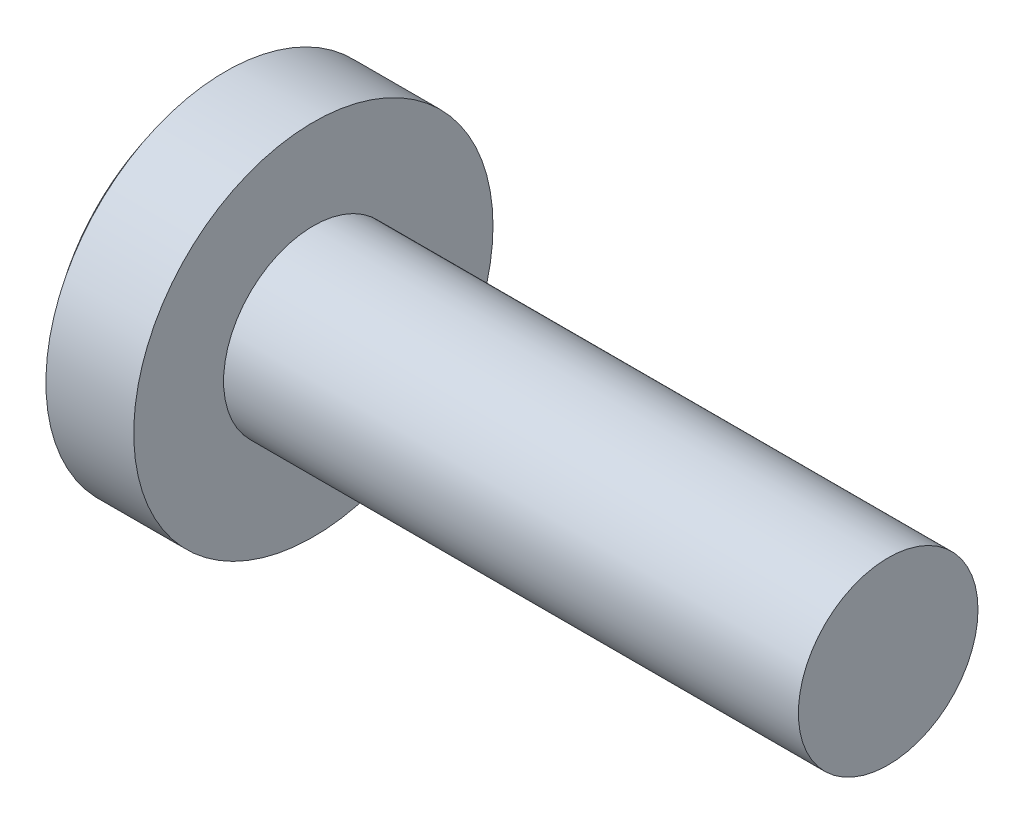
ISO-10303-21;
HEADER;
FILE_DESCRIPTION(('STEP AP214'),'2;1');
FILE_NAME('part.step','',(''),(''),'','','');
FILE_SCHEMA(('AUTOMOTIVE_DESIGN { 1 0 10303 214 1 1 1 1 }'));
ENDSEC;
DATA;
#1=APPLICATION_CONTEXT('core data for automotive mechanical design processes');
#2=APPLICATION_PROTOCOL_DEFINITION('international standard','automotive_design',2000,#1);
#3=PRODUCT_CONTEXT('',#1,'mechanical');
#4=PRODUCT('Part','Part','',(#3));
#5=PRODUCT_RELATED_PRODUCT_CATEGORY('part','',(#4));
#6=PRODUCT_DEFINITION_FORMATION('','',#4);
#7=PRODUCT_DEFINITION_CONTEXT('part definition',#1,'design');
#8=PRODUCT_DEFINITION('design','',#6,#7);
#9=PRODUCT_DEFINITION_SHAPE('','',#8);
#10=(LENGTH_UNIT() NAMED_UNIT(*) SI_UNIT(.MILLI.,.METRE.));
#11=(NAMED_UNIT(*) PLANE_ANGLE_UNIT() SI_UNIT($,.RADIAN.));
#12=(NAMED_UNIT(*) SI_UNIT($,.STERADIAN.) SOLID_ANGLE_UNIT());
#13=UNCERTAINTY_MEASURE_WITH_UNIT(LENGTH_MEASURE(1.E-05),#10,'distance_accuracy_value','');
#14=(GEOMETRIC_REPRESENTATION_CONTEXT(3) GLOBAL_UNCERTAINTY_ASSIGNED_CONTEXT((#13)) GLOBAL_UNIT_ASSIGNED_CONTEXT((#10,
#11,#12)) REPRESENTATION_CONTEXT('',''));
#15=CARTESIAN_POINT('',(0.,0.,0.));
#16=DIRECTION('',(0.,0.,1.));
#17=DIRECTION('',(1.,0.,0.));
#18=AXIS2_PLACEMENT_3D('',#15,#16,#17);
#19=CARTESIAN_POINT('',(4.00000000000003,0.,0.));
#20=DIRECTION('',(1.,0.,0.));
#21=DIRECTION('',(0.,0.999999999999999,0.));
#22=AXIS2_PLACEMENT_3D('',#19,#20,#21);
#23=SPHERICAL_SURFACE('',#22,4.);
#24=CARTESIAN_POINT('',(0.877501000800831,0.,0.));
#25=DIRECTION('',(1.,0.,0.));
#26=DIRECTION('',(0.,0.,-1.));
#27=AXIS2_PLACEMENT_3D('',#24,#25,#26);
#28=CIRCLE('',#27,2.5);
#29=CARTESIAN_POINT('',(0.877501000800831,0.,-2.50000000000006));
#30=VERTEX_POINT('',#29);
#31=EDGE_CURVE('E238',#30,#30,#28,.T.);
#32=ORIENTED_EDGE('',*,*,#31,.F.);
#33=EDGE_LOOP('',(#32));
#34=FACE_BOUND('',#33,.T.);
#35=CARTESIAN_POINT('',(4.00000000000003,-0.270000000000041,1.94289029309402E-13));
#36=DIRECTION('',(0.,1.,0.));
#37=DIRECTION('',(0.,0.,0.999999999999999));
#38=AXIS2_PLACEMENT_3D('',#35,#36,#37);
#39=CIRCLE('',#38,3.99087709657915);
#40=CARTESIAN_POINT('',(0.204098003289626,-0.269999999999875,1.23216396285989));
#41=VERTEX_POINT('',#40);
#42=CARTESIAN_POINT('',(0.0500379748661125,-0.269999999999708,0.570000000000126));
#43=VERTEX_POINT('',#42);
#44=EDGE_CURVE('E164',#41,#43,#39,.F.);
#45=ORIENTED_EDGE('',*,*,#44,.T.);
#46=CARTESIAN_POINT('',(0.0500379748661125,-0.269999999999708,0.570000000000126));
#47=CARTESIAN_POINT('',(0.0476365178428042,-0.269985184552494,0.553373124210486));
#48=CARTESIAN_POINT('',(0.0454365510042585,-0.27138160355786,0.536716423851874));
#49=CARTESIAN_POINT('',(0.0414945222549717,-0.276920928483508,0.503814447887959));
#50=CARTESIAN_POINT('',(0.0397523590868071,-0.281063226352656,0.487569082022859));
#51=CARTESIAN_POINT('',(0.0367783746538531,-0.292023458963572,0.455938437330691));
#52=CARTESIAN_POINT('',(0.0355470274039683,-0.298843867504526,0.440553968777926));
#53=CARTESIAN_POINT('',(0.0336346247987305,-0.31497358110974,0.41111996094181));
#54=CARTESIAN_POINT('',(0.0329533539085992,-0.324281909435062,0.397069900707179));
#55=CARTESIAN_POINT('',(0.0321661245530753,-0.345012414579545,0.370859945854032));
#56=CARTESIAN_POINT('',(0.0320539368362138,-0.356410282064379,0.358681006749266));
#57=CARTESIAN_POINT('',(0.0323915144837283,-0.381061876423687,0.336379293067998));
#58=CARTESIAN_POINT('',(0.0328413529561471,-0.394315844539517,0.326256786190161));
#59=CARTESIAN_POINT('',(0.0342854793189419,-0.422222756005893,0.308399045220797));
#60=CARTESIAN_POINT('',(0.0352770585079761,-0.436868442273225,0.300652231095505));
#61=CARTESIAN_POINT('',(0.0377733498840623,-0.467195800491755,0.287682726898461));
#62=CARTESIAN_POINT('',(0.0392779221655499,-0.482877189042834,0.282459349562497));
#63=CARTESIAN_POINT('',(0.0422857118746872,-0.51051670914062,0.275710674843325));
#64=CARTESIAN_POINT('',(0.043680199533087,-0.522340381271561,0.273568319498996));
#65=CARTESIAN_POINT('',(0.0466949672489457,-0.546113264286471,0.270712687639845));
#66=CARTESIAN_POINT('',(0.0483149200494709,-0.558062270415653,0.269997362497121));
#67=CARTESIAN_POINT('',(0.0500379748661134,-0.570000000000126,0.269999999999937));
#68=B_SPLINE_CURVE_WITH_KNOTS('',3,(#46,#47,#48,#49,#50,#51,#52,#53,#54,#55,#56,#57,#58,#59,#60,
#61,#62,#63,#64,#65,#66,#67),.UNSPECIFIED.,.F.,.F.,(4,2,2,2,2,2,2,2,2,2,4),(0.,
0.050340275914424,0.100669408132157,0.151045139681411,0.201401123066347,0.251204696018701,
0.301014748065684,0.350577999468998,0.400127744578377,0.436335011021502,0.472490261222945),.UNSPECIFIED.);
#69=CARTESIAN_POINT('',(0.0500379748661134,-0.570000000000126,0.269999999999937));
#70=VERTEX_POINT('',#69);
#71=EDGE_CURVE('E149',#43,#70,#68,.T.);
#72=ORIENTED_EDGE('',*,*,#71,.T.);
#73=CARTESIAN_POINT('',(4.00000000000004,-2.70616862252382E-13,0.269999999999743));
#74=DIRECTION('',(0.,0.,-1.));
#75=DIRECTION('',(0.,0.999999999999999,0.));
#76=AXIS2_PLACEMENT_3D('',#73,#74,#75);
#77=CIRCLE('',#76,3.99087709657915);
#78=CARTESIAN_POINT('',(0.204098003289605,-1.23216396285963,0.269999999999923));
#79=VERTEX_POINT('',#78);
#80=EDGE_CURVE('E173',#70,#79,#77,.F.);
#81=ORIENTED_EDGE('',*,*,#80,.T.);
#82=CARTESIAN_POINT('',(3.58456714755454,0.719550807568865,-2.08166817117217E-13));
#83=DIRECTION('',(-0.500000000000003,0.866025403784437,0.));
#84=DIRECTION('',(-0.866025403784442,-0.500000000000001,0.));
#85=AXIS2_PLACEMENT_3D('',#82,#83,#84);
#86=CIRCLE('',#85,3.91275634054);
#87=CARTESIAN_POINT('',(0.204098003289641,-1.23216396285969,-0.269999999999784));
#88=VERTEX_POINT('',#87);
#89=EDGE_CURVE('E176',#79,#88,#86,.F.);
#90=ORIENTED_EDGE('',*,*,#89,.T.);
#91=CARTESIAN_POINT('',(4.00000000000004,0.,-0.270000000000194));
#92=DIRECTION('',(0.,0.,1.));
#93=DIRECTION('',(1.,0.,0.));
#94=AXIS2_PLACEMENT_3D('',#91,#92,#93);
#95=CIRCLE('',#94,3.99087709657915);
#96=CARTESIAN_POINT('',(0.0500379748661029,-0.57000000000007,-0.270000000000069));
#97=VERTEX_POINT('',#96);
#98=EDGE_CURVE('E266',#88,#97,#95,.F.);
#99=ORIENTED_EDGE('',*,*,#98,.T.);
#100=CARTESIAN_POINT('',(0.0500379748661029,-0.57000000000007,-0.270000000000069));
#101=CARTESIAN_POINT('',(0.0476365178428165,-0.553373124210525,-0.269985184553142));
#102=CARTESIAN_POINT('',(0.0454365510042719,-0.536716423851851,-0.271381603558377));
#103=CARTESIAN_POINT('',(0.041494522254977,-0.503814447887767,-0.276920928483654));
#104=CARTESIAN_POINT('',(0.0397523590868037,-0.48756908202256,-0.281063226352564));
#105=CARTESIAN_POINT('',(0.0367783746538686,-0.455938437330545,-0.292023458963583));
#106=CARTESIAN_POINT('',(0.035547027404008,-0.440553968778035,-0.298843867504861));
#107=CARTESIAN_POINT('',(0.0336346247987634,-0.411119960941992,-0.314973581109942));
#108=CARTESIAN_POINT('',(0.0329533539086009,-0.397069900707179,-0.324281909434806));
#109=CARTESIAN_POINT('',(0.0321661245530739,-0.370859945854137,-0.345012414579102));
#110=CARTESIAN_POINT('',(0.032053936836242,-0.358681006749658,-0.356410282064208));
#111=CARTESIAN_POINT('',(0.0323915144837608,-0.336379293068539,-0.381061876423621));
#112=CARTESIAN_POINT('',(0.032841352956155,-0.326256786190566,-0.394315844539287));
#113=CARTESIAN_POINT('',(0.0342854793189419,-0.308399045221053,-0.422222756005631));
#114=CARTESIAN_POINT('',(0.0352770585079974,-0.300652231095767,-0.436868442273106));
#115=CARTESIAN_POINT('',(0.0377733498840705,-0.287682726898643,-0.467195800491854));
#116=CARTESIAN_POINT('',(0.0392779221655235,-0.282459349562591,-0.482877189043007));
#117=CARTESIAN_POINT('',(0.0422857118746707,-0.275710674843401,-0.5105167091408));
#118=CARTESIAN_POINT('',(0.0436801995330887,-0.273568319499098,-0.522340381271661));
#119=CARTESIAN_POINT('',(0.0466949672489684,-0.270712687639989,-0.546113264286423));
#120=CARTESIAN_POINT('',(0.0483149200494965,-0.269997362497282,-0.558062270415538));
#121=CARTESIAN_POINT('',(0.0500379748661021,-0.270000000000097,-0.569999999999939));
#122=B_SPLINE_CURVE_WITH_KNOTS('',3,(#100,#101,#102,#103,#104,#105,#106,#107,#108,#109,#110,
#111,#112,#113,#114,#115,#116,#117,#118,#119,#120,#121),.UNSPECIFIED.,.F.,.F.,(4,2,2,2,2,2,2,2,
2,2,4),(0.,0.0503402759144627,0.100669408132281,0.151045139681269,0.201401123065908,
0.251204696018142,0.301014748065041,0.35057799946869,0.40012774457837,0.436335011021249,
0.472490261222481),.UNSPECIFIED.);
#123=CARTESIAN_POINT('',(0.0500379748661021,-0.270000000000097,-0.569999999999939));
#124=VERTEX_POINT('',#123);
#125=EDGE_CURVE('E160',#97,#124,#122,.T.);
#126=ORIENTED_EDGE('',*,*,#125,.T.);
#127=CARTESIAN_POINT('',(4.00000000000003,-0.270000000000041,1.94289029309402E-13));
#128=DIRECTION('',(0.,0.999999999999999,0.));
#129=DIRECTION('',(0.,0.,1.));
#130=AXIS2_PLACEMENT_3D('',#127,#128,#129);
#131=CIRCLE('',#130,3.99087709657915);
#132=CARTESIAN_POINT('',(0.204098003289616,-0.269999999999992,-1.23216396285973));
#133=VERTEX_POINT('',#132);
#134=EDGE_CURVE('E265',#124,#133,#131,.F.);
#135=ORIENTED_EDGE('',*,*,#134,.T.);
#136=CARTESIAN_POINT('',(3.58456714755454,0.,0.719550807568733));
#137=DIRECTION('',(-0.500000000000003,0.,0.866025403784439));
#138=DIRECTION('',(0.866025403784442,0.,0.500000000000002));
#139=AXIS2_PLACEMENT_3D('',#136,#137,#138);
#140=CIRCLE('',#139,3.91275634054);
#141=CARTESIAN_POINT('',(0.204098003289619,0.269999999999999,-1.23216396285981));
#142=VERTEX_POINT('',#141);
#143=EDGE_CURVE('E264',#133,#142,#140,.F.);
#144=ORIENTED_EDGE('',*,*,#143,.T.);
#145=CARTESIAN_POINT('',(4.00000000000003,0.269999999999937,0.));
#146=DIRECTION('',(0.,-0.999999999999999,0.));
#147=DIRECTION('',(0.,0.,-1.));
#148=AXIS2_PLACEMENT_3D('',#145,#146,#147);
#149=CIRCLE('',#148,3.99087709657915);
#150=CARTESIAN_POINT('',(0.0500379748661012,0.269999999999999,-0.569999999999925));
#151=VERTEX_POINT('',#150);
#152=EDGE_CURVE('E261',#142,#151,#149,.F.);
#153=ORIENTED_EDGE('',*,*,#152,.T.);
#154=CARTESIAN_POINT('',(0.0500379748661012,0.269999999999999,-0.569999999999925));
#155=CARTESIAN_POINT('',(0.0476365178427653,0.269985184552828,-0.553373124210335));
#156=CARTESIAN_POINT('',(0.0454365510042193,0.271381603558045,-0.536716423851665));
#157=CARTESIAN_POINT('',(0.041494522254949,0.276920928483414,-0.503814447887631));
#158=CARTESIAN_POINT('',(0.039752359086801,0.281063226352429,-0.487569082022471));
#159=CARTESIAN_POINT('',(0.0367783746538622,0.292023458963476,-0.455938437330423));
#160=CARTESIAN_POINT('',(0.0355470274039744,0.298843867504686,-0.440553968777837));
#161=CARTESIAN_POINT('',(0.0336346247987289,0.314973581109855,-0.411119960941745));
#162=CARTESIAN_POINT('',(0.032953353908593,0.324281909434876,-0.39706990070696));
#163=CARTESIAN_POINT('',(0.0321661245530798,0.345012414579296,-0.370859945853949));
#164=CARTESIAN_POINT('',(0.0320539368362334,0.356410282064361,-0.358681006749468));
#165=CARTESIAN_POINT('',(0.0323915144837456,0.381061876423662,-0.336379293068259));
#166=CARTESIAN_POINT('',(0.0328413529561473,0.394315844539254,-0.326256786190195));
#167=CARTESIAN_POINT('',(0.034285479318946,0.422222756005606,-0.308399045220813));
#168=CARTESIAN_POINT('',(0.0352770585080059,0.436868442273162,-0.300652231095746));
#169=CARTESIAN_POINT('',(0.0377733498840755,0.467195800491913,-0.287682726898643));
#170=CARTESIAN_POINT('',(0.039277922165521,0.482877189042989,-0.282459349562396));
#171=CARTESIAN_POINT('',(0.0422857118746738,0.51051670914078,-0.275710674843273));
#172=CARTESIAN_POINT('',(0.0436801995331013,0.522340381271688,-0.273568319499126));
#173=CARTESIAN_POINT('',(0.0466949672489883,0.546113264286518,-0.270712687640183));
#174=CARTESIAN_POINT('',(0.0483149200495141,0.558062270415652,-0.269997362497487));
#175=CARTESIAN_POINT('',(0.0500379748661012,0.570000000000022,-0.270000000000034));
#176=B_SPLINE_CURVE_WITH_KNOTS('',3,(#154,#155,#156,#157,#158,#159,#160,#161,#162,#163,#164,
#165,#166,#167,#168,#169,#170,#171,#172,#173,#174,#175),.UNSPECIFIED.,.F.,.F.,(4,2,2,2,2,2,2,2,
2,2,4),(0.,0.0503402759144768,0.100669408132236,0.151045139681354,0.20140112306616,
0.251204696018365,0.301014748065203,0.350577999468785,0.400127744578427,0.436335011021359,
0.472490261222617),.UNSPECIFIED.);
#177=CARTESIAN_POINT('',(0.0500379748661012,0.570000000000022,-0.270000000000034));
#178=VERTEX_POINT('',#177);
#179=EDGE_CURVE('E167',#151,#178,#176,.T.);
#180=ORIENTED_EDGE('',*,*,#179,.T.);
#181=CARTESIAN_POINT('',(4.00000000000004,0.,-0.270000000000194));
#182=DIRECTION('',(0.,0.,1.));
#183=DIRECTION('',(1.,0.,0.));
#184=AXIS2_PLACEMENT_3D('',#181,#182,#183);
#185=CIRCLE('',#184,3.99087709657915);
#186=CARTESIAN_POINT('',(0.204098003289628,1.2321639628597,-0.269999999999979));
#187=VERTEX_POINT('',#186);
#188=EDGE_CURVE('E259',#178,#187,#185,.F.);
#189=ORIENTED_EDGE('',*,*,#188,.T.);
#190=CARTESIAN_POINT('',(3.58456714755454,-0.719550807569025,-1.2490009027033E-13));
#191=DIRECTION('',(-0.500000000000003,-0.86602540378444,0.));
#192=DIRECTION('',(0.866025403784442,-0.500000000000002,0.));
#193=AXIS2_PLACEMENT_3D('',#190,#191,#192);
#194=CIRCLE('',#193,3.91275634054);
#195=CARTESIAN_POINT('',(0.204098003289599,1.23216396285981,0.269999999999729));
#196=VERTEX_POINT('',#195);
#197=EDGE_CURVE('E258',#187,#196,#194,.F.);
#198=ORIENTED_EDGE('',*,*,#197,.T.);
#199=CARTESIAN_POINT('',(4.00000000000004,-2.70616862252382E-13,0.269999999999743));
#200=DIRECTION('',(0.,0.,-0.999999999999999));
#201=DIRECTION('',(0.,1.,0.));
#202=AXIS2_PLACEMENT_3D('',#199,#200,#201);
#203=CIRCLE('',#202,3.99087709657915);
#204=CARTESIAN_POINT('',(0.0500379748660804,0.570000000000126,0.270000000000173));
#205=VERTEX_POINT('',#204);
#206=EDGE_CURVE('E255',#196,#205,#203,.F.);
#207=ORIENTED_EDGE('',*,*,#206,.T.);
#208=CARTESIAN_POINT('',(0.0500379748660804,0.570000000000126,0.270000000000173));
#209=CARTESIAN_POINT('',(0.0476365178427624,0.553373124210416,0.269985184552697));
#210=CARTESIAN_POINT('',(0.0454365510042224,0.53671642385173,0.271381603557916));
#211=CARTESIAN_POINT('',(0.0414945222549525,0.503814447887699,0.276920928483413));
#212=CARTESIAN_POINT('',(0.0397523590867985,0.487569082022558,0.281063226352553));
#213=CARTESIAN_POINT('',(0.0367783746538508,0.455938437330451,0.292023458963465));
#214=CARTESIAN_POINT('',(0.0355470274039577,0.440553968777784,0.298843867504403));
#215=CARTESIAN_POINT('',(0.0336346247987169,0.411119960941894,0.314973581109608));
#216=CARTESIAN_POINT('',(0.0329533539085912,0.397069900707394,0.324281909434938));
#217=CARTESIAN_POINT('',(0.0321661245530579,0.370859945854221,0.345012414579314));
#218=CARTESIAN_POINT('',(0.0320539368361857,0.358681006749313,0.356410282064052));
#219=CARTESIAN_POINT('',(0.0323915144837039,0.33637929306802,0.381061876423387));
#220=CARTESIAN_POINT('',(0.0328413529561372,0.3262567861903,0.394315844539342));
#221=CARTESIAN_POINT('',(0.0342854793189297,0.308399045220861,0.422222756005786));
#222=CARTESIAN_POINT('',(0.0352770585079478,0.30065223109538,0.436868442273063));
#223=CARTESIAN_POINT('',(0.0377733498840293,0.287682726898234,0.467195800491608));
#224=CARTESIAN_POINT('',(0.0392779221655282,0.282459349562357,0.482877189042758));
#225=CARTESIAN_POINT('',(0.0422857118746647,0.275710674843167,0.510516709140553));
#226=CARTESIAN_POINT('',(0.0436801995330547,0.273568319498776,0.522340381271443));
#227=CARTESIAN_POINT('',(0.0466949672489052,0.270712687639629,0.546113264286271));
#228=CARTESIAN_POINT('',(0.0483149200494319,0.269997362496972,0.558062270415422));
#229=CARTESIAN_POINT('',(0.0500379748660917,0.270000000000048,0.56999999999989));
#230=B_SPLINE_CURVE_WITH_KNOTS('',3,(#208,#209,#210,#211,#212,#213,#214,#215,#216,#217,#218,
#219,#220,#221,#222,#223,#224,#225,#226,#227,#228,#229),.UNSPECIFIED.,.F.,.F.,(4,2,2,2,2,2,2,2,
2,2,4),(0.,0.0503402759145948,0.100669408132425,0.15104513968138,0.20140112306604,
0.251204696018483,0.301014748065558,0.350577999468997,0.400127744578482,0.436335011021489,
0.472490261222843),.UNSPECIFIED.);
#231=CARTESIAN_POINT('',(0.0500379748660917,0.270000000000048,0.56999999999989));
#232=VERTEX_POINT('',#231);
#233=EDGE_CURVE('E187',#205,#232,#230,.T.);
#234=ORIENTED_EDGE('',*,*,#233,.T.);
#235=CARTESIAN_POINT('',(4.00000000000003,0.269999999999937,0.));
#236=DIRECTION('',(0.,-1.,0.));
#237=DIRECTION('',(0.,0.,-0.999999999999999));
#238=AXIS2_PLACEMENT_3D('',#235,#236,#237);
#239=CIRCLE('',#238,3.99087709657915);
#240=CARTESIAN_POINT('',(0.204098003289631,0.269999999999937,1.23216396285959));
#241=VERTEX_POINT('',#240);
#242=EDGE_CURVE('E168',#232,#241,#239,.F.);
#243=ORIENTED_EDGE('',*,*,#242,.T.);
#244=CARTESIAN_POINT('',(3.58456714755455,0.,-0.719550807569268));
#245=DIRECTION('',(-0.500000000000003,0.,-0.866025403784439));
#246=DIRECTION('',(-0.866025403784442,0.,0.500000000000002));
#247=AXIS2_PLACEMENT_3D('',#244,#245,#246);
#248=CIRCLE('',#247,3.91275634054);
#249=EDGE_CURVE('E172',#241,#41,#248,.F.);
#250=ORIENTED_EDGE('',*,*,#249,.T.);
#251=EDGE_LOOP('',(#45,#72,#81,#90,#99,#126,#135,#144,#153,#180,#189,#198,#207,#234,#243,#250));
#252=FACE_BOUND('',#251,.T.);
#253=ADVANCED_FACE('F39',(#34,#252),#23,.T.);
#254=CARTESIAN_POINT('',(10.1,1.24999999999965,-1.66533453693773E-13));
#255=DIRECTION('',(1.,0.,0.));
#256=DIRECTION('',(0.,0.,-1.));
#257=AXIS2_PLACEMENT_3D('',#254,#255,#256);
#258=PLANE('',#257);
#259=CARTESIAN_POINT('',(10.1000000000001,-2.22044604925031E-13,2.70616862252382E-13));
#260=DIRECTION('',(1.,0.,0.));
#261=DIRECTION('',(0.,0.,-1.));
#262=AXIS2_PLACEMENT_3D('',#259,#260,#261);
#263=CIRCLE('',#262,1.25);
#264=CARTESIAN_POINT('',(10.1000000000001,-2.21211937656562E-13,-1.24999999999973));
#265=VERTEX_POINT('',#264);
#266=EDGE_CURVE('E252',#265,#265,#263,.T.);
#267=ORIENTED_EDGE('',*,*,#266,.T.);
#268=EDGE_LOOP('',(#267));
#269=FACE_BOUND('',#268,.T.);
#270=ADVANCED_FACE('F228',(#269),#258,.T.);
#271=CARTESIAN_POINT('',(4.51581291088135,0.,0.));
#272=DIRECTION('',(1.,0.,0.));
#273=DIRECTION('',(0.,0.,-1.));
#274=AXIS2_PLACEMENT_3D('',#271,#272,#273);
#275=CYLINDRICAL_SURFACE('',#274,1.25);
#276=CARTESIAN_POINT('',(2.10000000000004,0.,0.));
#277=DIRECTION('',(1.,0.,0.));
#278=DIRECTION('',(0.,0.,-1.));
#279=AXIS2_PLACEMENT_3D('',#276,#277,#278);
#280=CIRCLE('',#279,1.25);
#281=CARTESIAN_POINT('',(2.10000000000004,0.,-1.25000000000006));
#282=VERTEX_POINT('',#281);
#283=EDGE_CURVE('E245',#282,#282,#280,.T.);
#284=ORIENTED_EDGE('',*,*,#283,.T.);
#285=EDGE_LOOP('',(#284));
#286=FACE_BOUND('',#285,.T.);
#287=ORIENTED_EDGE('',*,*,#266,.F.);
#288=EDGE_LOOP('',(#287));
#289=FACE_BOUND('',#288,.T.);
#290=ADVANCED_FACE('F233',(#286,#289),#275,.T.);
#291=CARTESIAN_POINT('',(2.10000000000005,1.55000000000006,0.));
#292=DIRECTION('',(1.,0.,0.));
#293=DIRECTION('',(0.,0.,-1.));
#294=AXIS2_PLACEMENT_3D('',#291,#292,#293);
#295=PLANE('',#294);
#296=CARTESIAN_POINT('',(2.10000000000004,0.,0.));
#297=DIRECTION('',(1.,0.,0.));
#298=DIRECTION('',(0.,0.,-1.));
#299=AXIS2_PLACEMENT_3D('',#296,#297,#298);
#300=CIRCLE('',#299,2.5);
#301=CARTESIAN_POINT('',(2.10000000000004,0.,-2.50000000000006));
#302=VERTEX_POINT('',#301);
#303=EDGE_CURVE('E240',#302,#302,#300,.T.);
#304=ORIENTED_EDGE('',*,*,#303,.T.);
#305=EDGE_LOOP('',(#304));
#306=FACE_BOUND('',#305,.T.);
#307=ORIENTED_EDGE('',*,*,#283,.F.);
#308=EDGE_LOOP('',(#307));
#309=FACE_BOUND('',#308,.T.);
#310=ADVANCED_FACE('F482',(#306,#309),#295,.T.);
#311=CARTESIAN_POINT('',(4.51581291088135,0.,0.));
#312=DIRECTION('',(1.,0.,0.));
#313=DIRECTION('',(0.,0.,-1.));
#314=AXIS2_PLACEMENT_3D('',#311,#312,#313);
#315=CYLINDRICAL_SURFACE('',#314,2.5);
#316=ORIENTED_EDGE('',*,*,#31,.T.);
#317=EDGE_LOOP('',(#316));
#318=FACE_BOUND('',#317,.T.);
#319=ORIENTED_EDGE('',*,*,#303,.F.);
#320=EDGE_LOOP('',(#319));
#321=FACE_BOUND('',#320,.T.);
#322=ADVANCED_FACE('F224',(#318,#321),#315,.T.);
#323=CARTESIAN_POINT('',(1.47000000000004,0.269999999999881,0.269999999999909));
#324=DIRECTION('',(0.,-1.,0.));
#325=DIRECTION('',(0.,0.,-0.999999999999999));
#326=AXIS2_PLACEMENT_3D('',#323,#324,#325);
#327=PLANE('',#326);
#328=ORIENTED_EDGE('',*,*,#242,.F.);
#329=DIRECTION('',(-1.,0.,0.));
#330=VECTOR('',#329,1.);
#331=CARTESIAN_POINT('',(1.47000000000004,0.269999999999937,0.569999999999564));
#332=LINE('',#331,#330);
#333=CARTESIAN_POINT('',(1.35099962990375,0.269999999999881,0.569999999999647));
#334=VERTEX_POINT('',#333);
#335=EDGE_CURVE('E343',#232,#334,#332,.F.);
#336=ORIENTED_EDGE('',*,*,#335,.T.);
#337=DIRECTION('',(-0.866025403784442,0.,0.500000000000001));
#338=VECTOR('',#337,1.);
#339=CARTESIAN_POINT('',(0.,0.269999999999999,1.35000000000018));
#340=LINE('',#339,#338);
#341=EDGE_CURVE('E241',#334,#241,#340,.T.);
#342=ORIENTED_EDGE('',*,*,#341,.T.);
#343=EDGE_LOOP('',(#328,#336,#342));
#344=FACE_BOUND('',#343,.T.);
#345=ADVANCED_FACE('F217',(#344),#327,.T.);
#346=CARTESIAN_POINT('',(0.,0.,1.34999999999992));
#347=DIRECTION('',(-0.500000000000003,0.,-0.866025403784439));
#348=DIRECTION('',(-0.866025403784442,0.,0.500000000000002));
#349=AXIS2_PLACEMENT_3D('',#346,#347,#348);
#350=PLANE('',#349);
#351=ORIENTED_EDGE('',*,*,#341,.F.);
#352=CARTESIAN_POINT('',(1.35099962990374,0.569999999999918,0.569999999999869));
#353=DIRECTION('',(-0.500000000000003,0.,-0.866025403784439));
#354=DIRECTION('',(-0.866025403784442,0.,0.500000000000002));
#355=AXIS2_PLACEMENT_3D('',#352,#353,#354);
#356=ELLIPSE('',#355,0.599999999999999,0.3);
#357=CARTESIAN_POINT('',(1.47000000000003,0.277973225019212,0.501295104291123));
#358=VERTEX_POINT('',#357);
#359=EDGE_CURVE('E310',#334,#358,#356,.F.);
#360=ORIENTED_EDGE('',*,*,#359,.T.);
#361=DIRECTION('',(0.,-0.999999999999999,0.));
#362=VECTOR('',#361,1.);
#363=CARTESIAN_POINT('',(1.47000000000003,1.17961196366423E-13,0.501295104291082));
#364=LINE('',#363,#362);
#365=CARTESIAN_POINT('',(1.47000000000005,-0.277973225019094,0.501295104291408));
#366=VERTEX_POINT('',#365);
#367=EDGE_CURVE('E282',#358,#366,#364,.T.);
#368=ORIENTED_EDGE('',*,*,#367,.T.);
#369=CARTESIAN_POINT('',(1.35099962990378,-0.569999999999842,0.569999999999599));
#370=DIRECTION('',(-0.500000000000003,0.,-0.866025403784439));
#371=DIRECTION('',(-0.866025403784442,0.,0.500000000000002));
#372=AXIS2_PLACEMENT_3D('',#369,#370,#371);
#373=ELLIPSE('',#372,0.599999999999999,0.3);
#374=CARTESIAN_POINT('',(1.35099962990377,-0.269999999999826,0.569999999999939));
#375=VERTEX_POINT('',#374);
#376=EDGE_CURVE('E305',#375,#366,#373,.T.);
#377=ORIENTED_EDGE('',*,*,#376,.F.);
#378=DIRECTION('',(-0.866025403784442,0.,0.500000000000001));
#379=VECTOR('',#378,1.);
#380=CARTESIAN_POINT('',(1.57015371804363,-0.270000000000048,0.443471328218252));
#381=LINE('',#380,#379);
#382=EDGE_CURVE('E166',#375,#41,#381,.T.);
#383=ORIENTED_EDGE('',*,*,#382,.T.);
#384=ORIENTED_EDGE('',*,*,#249,.F.);
#385=EDGE_LOOP('',(#351,#360,#368,#377,#383,#384));
#386=FACE_BOUND('',#385,.T.);
#387=ADVANCED_FACE('F215',(#386),#350,.T.);
#388=CARTESIAN_POINT('',(1.47000000000003,-0.269999999999986,0.270000000000062));
#389=DIRECTION('',(0.,1.,0.));
#390=DIRECTION('',(0.,0.,0.999999999999999));
#391=AXIS2_PLACEMENT_3D('',#388,#389,#390);
#392=PLANE('',#391);
#393=ORIENTED_EDGE('',*,*,#382,.F.);
#394=DIRECTION('',(-1.,0.,0.));
#395=VECTOR('',#394,1.);
#396=CARTESIAN_POINT('',(1.47000000000005,-0.269999999999819,0.570000000000029));
#397=LINE('',#396,#395);
#398=EDGE_CURVE('E153',#375,#43,#397,.T.);
#399=ORIENTED_EDGE('',*,*,#398,.T.);
#400=ORIENTED_EDGE('',*,*,#44,.F.);
#401=EDGE_LOOP('',(#393,#399,#400));
#402=FACE_BOUND('',#401,.T.);
#403=ADVANCED_FACE('F163',(#402),#392,.T.);
#404=CARTESIAN_POINT('',(1.47000000000003,-0.269999999999986,0.270000000000062));
#405=DIRECTION('',(0.,0.,-1.));
#406=DIRECTION('',(0.,0.999999999999999,0.));
#407=AXIS2_PLACEMENT_3D('',#404,#405,#406);
#408=PLANE('',#407);
#409=ORIENTED_EDGE('',*,*,#80,.F.);
#410=DIRECTION('',(-1.,0.,0.));
#411=VECTOR('',#410,1.);
#412=CARTESIAN_POINT('',(1.47000000000005,-0.570000000000175,0.269999999999895));
#413=LINE('',#412,#411);
#414=CARTESIAN_POINT('',(1.35099962990377,-0.569999999999842,0.269999999999784));
#415=VERTEX_POINT('',#414);
#416=EDGE_CURVE('E156',#70,#415,#413,.F.);
#417=ORIENTED_EDGE('',*,*,#416,.T.);
#418=DIRECTION('',(-0.866025403784442,-0.500000000000001,0.));
#419=VECTOR('',#418,1.);
#420=CARTESIAN_POINT('',(0.,-1.35000000000013,0.270000000000159));
#421=LINE('',#420,#419);
#422=EDGE_CURVE('E273',#415,#79,#421,.T.);
#423=ORIENTED_EDGE('',*,*,#422,.T.);
#424=EDGE_LOOP('',(#409,#417,#423));
#425=FACE_BOUND('',#424,.T.);
#426=ADVANCED_FACE('F208',(#425),#408,.T.);
#427=CARTESIAN_POINT('',(0.,-1.34999999999996,0.));
#428=DIRECTION('',(-0.500000000000003,0.866025403784437,0.));
#429=DIRECTION('',(-0.866025403784442,-0.500000000000001,0.));
#430=AXIS2_PLACEMENT_3D('',#427,#428,#429);
#431=PLANE('',#430);
#432=ORIENTED_EDGE('',*,*,#422,.F.);
#433=CARTESIAN_POINT('',(1.35099962990378,-0.569999999999842,0.569999999999599));
#434=DIRECTION('',(-0.500000000000003,0.866025403784437,0.));
#435=DIRECTION('',(-0.866025403784442,-0.500000000000001,0.));
#436=AXIS2_PLACEMENT_3D('',#433,#434,#435);
#437=ELLIPSE('',#436,0.599999999999999,0.3);
#438=CARTESIAN_POINT('',(1.47000000000005,-0.501295104291637,0.277973225019282));
#439=VERTEX_POINT('',#438);
#440=EDGE_CURVE('E285',#415,#439,#437,.F.);
#441=ORIENTED_EDGE('',*,*,#440,.T.);
#442=DIRECTION('',(0.,0.,-1.));
#443=VECTOR('',#442,1.);
#444=CARTESIAN_POINT('',(1.47000000000003,-0.501295104291026,-2.4980018054066E-13));
#445=LINE('',#444,#443);
#446=CARTESIAN_POINT('',(1.47000000000004,-0.501295104291026,-0.27797322501949));
#447=VERTEX_POINT('',#446);
#448=EDGE_CURVE('E279',#439,#447,#445,.T.);
#449=ORIENTED_EDGE('',*,*,#448,.T.);
#450=CARTESIAN_POINT('',(1.35099962990376,-0.570000000000008,-0.570000000000251));
#451=DIRECTION('',(-0.500000000000003,0.866025403784437,0.));
#452=DIRECTION('',(-0.866025403784442,-0.500000000000001,0.));
#453=AXIS2_PLACEMENT_3D('',#450,#451,#452);
#454=ELLIPSE('',#453,0.599999999999999,0.3);
#455=CARTESIAN_POINT('',(1.35099962990376,-0.570000000000008,-0.270000000000284));
#456=VERTEX_POINT('',#455);
#457=EDGE_CURVE('E283',#456,#447,#454,.T.);
#458=ORIENTED_EDGE('',*,*,#457,.F.);
#459=DIRECTION('',(-0.866025403784442,-0.500000000000001,0.));
#460=VECTOR('',#459,1.);
#461=CARTESIAN_POINT('',(1.57015371804364,-0.443471328218425,-0.270000000000124));
#462=LINE('',#461,#460);
#463=EDGE_CURVE('E275',#456,#88,#462,.T.);
#464=ORIENTED_EDGE('',*,*,#463,.T.);
#465=ORIENTED_EDGE('',*,*,#89,.F.);
#466=EDGE_LOOP('',(#432,#441,#449,#458,#464,#465));
#467=FACE_BOUND('',#466,.T.);
#468=ADVANCED_FACE('F204',(#467),#431,.T.);
#469=CARTESIAN_POINT('',(1.47000000000004,-0.269999999999992,-0.270000000000062));
#470=DIRECTION('',(0.,0.,1.));
#471=DIRECTION('',(1.,0.,0.));
#472=AXIS2_PLACEMENT_3D('',#469,#470,#471);
#473=PLANE('',#472);
#474=ORIENTED_EDGE('',*,*,#463,.F.);
#475=DIRECTION('',(-1.,0.,0.));
#476=VECTOR('',#475,1.);
#477=CARTESIAN_POINT('',(1.47000000000004,-0.570000000000119,-0.270000000000235));
#478=LINE('',#477,#476);
#479=EDGE_CURVE('E352',#456,#97,#478,.T.);
#480=ORIENTED_EDGE('',*,*,#479,.T.);
#481=ORIENTED_EDGE('',*,*,#98,.F.);
#482=EDGE_LOOP('',(#474,#480,#481));
#483=FACE_BOUND('',#482,.T.);
#484=ADVANCED_FACE('F207',(#483),#473,.T.);
#485=CARTESIAN_POINT('',(1.47000000000004,-0.269999999999992,-0.270000000000062));
#486=DIRECTION('',(0.,0.999999999999999,0.));
#487=DIRECTION('',(0.,0.,1.));
#488=AXIS2_PLACEMENT_3D('',#485,#486,#487);
#489=PLANE('',#488);
#490=ORIENTED_EDGE('',*,*,#134,.F.);
#491=DIRECTION('',(-1.,0.,0.));
#492=VECTOR('',#491,1.);
#493=CARTESIAN_POINT('',(1.47000000000004,-0.270000000000319,-0.570000000000043));
#494=LINE('',#493,#492);
#495=CARTESIAN_POINT('',(1.35099962990376,-0.270000000000319,-0.570000000000043));
#496=VERTEX_POINT('',#495);
#497=EDGE_CURVE('E349',#124,#496,#494,.F.);
#498=ORIENTED_EDGE('',*,*,#497,.T.);
#499=DIRECTION('',(-0.866025403784442,0.,-0.500000000000002));
#500=VECTOR('',#499,1.);
#501=CARTESIAN_POINT('',(0.,-0.270000000000208,-1.34999999999989));
#502=LINE('',#501,#500);
#503=EDGE_CURVE('E278',#496,#133,#502,.T.);
#504=ORIENTED_EDGE('',*,*,#503,.T.);
#505=EDGE_LOOP('',(#490,#498,#504));
#506=FACE_BOUND('',#505,.T.);
#507=ADVANCED_FACE('F213',(#506),#489,.T.);
#508=CARTESIAN_POINT('',(0.,2.22044604925031E-13,-1.34999999999989));
#509=DIRECTION('',(-0.500000000000003,0.,0.866025403784439));
#510=DIRECTION('',(0.866025403784442,0.,0.500000000000002));
#511=AXIS2_PLACEMENT_3D('',#508,#509,#510);
#512=PLANE('',#511);
#513=ORIENTED_EDGE('',*,*,#503,.F.);
#514=CARTESIAN_POINT('',(1.35099962990376,-0.570000000000008,-0.570000000000251));
#515=DIRECTION('',(-0.500000000000003,0.,0.866025403784439));
#516=DIRECTION('',(-0.866025403784442,0.,-0.500000000000002));
#517=AXIS2_PLACEMENT_3D('',#514,#515,#516);
#518=ELLIPSE('',#517,0.599999999999999,0.3);
#519=CARTESIAN_POINT('',(1.47000000000005,-0.277973225019421,-0.501295104291123));
#520=VERTEX_POINT('',#519);
#521=EDGE_CURVE('E11',#496,#520,#518,.F.);
#522=ORIENTED_EDGE('',*,*,#521,.T.);
#523=DIRECTION('',(0.,0.999999999999999,0.));
#524=VECTOR('',#523,1.);
#525=CARTESIAN_POINT('',(1.47000000000005,2.22044604925031E-13,-0.501295104291595));
#526=LINE('',#525,#524);
#527=CARTESIAN_POINT('',(1.47000000000005,0.277973225019053,-0.501295104291283));
#528=VERTEX_POINT('',#527);
#529=EDGE_CURVE('E281',#520,#528,#526,.T.);
#530=ORIENTED_EDGE('',*,*,#529,.T.);
#531=CARTESIAN_POINT('',(1.35099962990376,0.569999999999911,-0.570000000000168));
#532=DIRECTION('',(-0.500000000000003,0.,0.866025403784439));
#533=DIRECTION('',(-0.866025403784442,0.,-0.500000000000002));
#534=AXIS2_PLACEMENT_3D('',#531,#532,#533);
#535=ELLIPSE('',#534,0.599999999999999,0.3);
#536=CARTESIAN_POINT('',(1.35099962990377,0.269999999999999,-0.56999999999989));
#537=VERTEX_POINT('',#536);
#538=EDGE_CURVE('E48',#537,#528,#535,.T.);
#539=ORIENTED_EDGE('',*,*,#538,.F.);
#540=DIRECTION('',(-0.866025403784442,0.,-0.500000000000002));
#541=VECTOR('',#540,1.);
#542=CARTESIAN_POINT('',(1.57015371804364,0.269999999999944,-0.443471328218599));
#543=LINE('',#542,#541);
#544=EDGE_CURVE('E293',#537,#142,#543,.T.);
#545=ORIENTED_EDGE('',*,*,#544,.T.);
#546=ORIENTED_EDGE('',*,*,#143,.F.);
#547=EDGE_LOOP('',(#513,#522,#530,#539,#545,#546));
#548=FACE_BOUND('',#547,.T.);
#549=ADVANCED_FACE('F210',(#548),#512,.T.);
#550=CARTESIAN_POINT('',(1.47000000000005,0.269999999999833,-0.269999999999937));
#551=DIRECTION('',(0.,-0.999999999999999,0.));
#552=DIRECTION('',(0.,0.,-1.));
#553=AXIS2_PLACEMENT_3D('',#550,#551,#552);
#554=PLANE('',#553);
#555=ORIENTED_EDGE('',*,*,#544,.F.);
#556=DIRECTION('',(-1.,0.,0.));
#557=VECTOR('',#556,1.);
#558=CARTESIAN_POINT('',(1.47000000000005,0.269999999999999,-0.56999999999989));
#559=LINE('',#558,#557);
#560=EDGE_CURVE('E324',#537,#151,#559,.T.);
#561=ORIENTED_EDGE('',*,*,#560,.T.);
#562=ORIENTED_EDGE('',*,*,#152,.F.);
#563=EDGE_LOOP('',(#555,#561,#562));
#564=FACE_BOUND('',#563,.T.);
#565=ADVANCED_FACE('F212',(#564),#554,.T.);
#566=CARTESIAN_POINT('',(1.47000000000005,0.269999999999833,-0.269999999999937));
#567=DIRECTION('',(0.,0.,1.));
#568=DIRECTION('',(1.,0.,0.));
#569=AXIS2_PLACEMENT_3D('',#566,#567,#568);
#570=PLANE('',#569);
#571=ORIENTED_EDGE('',*,*,#188,.F.);
#572=DIRECTION('',(-1.,0.,0.));
#573=VECTOR('',#572,1.);
#574=CARTESIAN_POINT('',(1.47000000000005,0.569999999999911,-0.270000000000173));
#575=LINE('',#574,#573);
#576=CARTESIAN_POINT('',(1.35099962990377,0.569999999999911,-0.270000000000173));
#577=VERTEX_POINT('',#576);
#578=EDGE_CURVE('E339',#178,#577,#575,.F.);
#579=ORIENTED_EDGE('',*,*,#578,.T.);
#580=DIRECTION('',(-0.866025403784442,0.500000000000002,0.));
#581=VECTOR('',#580,1.);
#582=CARTESIAN_POINT('',(0.,1.35000000000008,-0.270000000000069));
#583=LINE('',#582,#581);
#584=EDGE_CURVE('E290',#577,#187,#583,.T.);
#585=ORIENTED_EDGE('',*,*,#584,.T.);
#586=EDGE_LOOP('',(#571,#579,#585));
#587=FACE_BOUND('',#586,.T.);
#588=ADVANCED_FACE('F386',(#587),#570,.T.);
#589=CARTESIAN_POINT('',(0.,1.35000000000008,-1.17961196366423E-13));
#590=DIRECTION('',(-0.500000000000003,-0.86602540378444,0.));
#591=DIRECTION('',(0.866025403784442,-0.500000000000002,0.));
#592=AXIS2_PLACEMENT_3D('',#589,#590,#591);
#593=PLANE('',#592);
#594=ORIENTED_EDGE('',*,*,#584,.F.);
#595=CARTESIAN_POINT('',(1.35099962990376,0.569999999999911,-0.570000000000168));
#596=DIRECTION('',(-0.500000000000003,-0.86602540378444,0.));
#597=DIRECTION('',(-0.866025403784442,0.500000000000002,0.));
#598=AXIS2_PLACEMENT_3D('',#595,#596,#597);
#599=ELLIPSE('',#598,0.599999999999999,0.3);
#600=CARTESIAN_POINT('',(1.47000000000005,0.501295104291366,-0.277973225019275));
#601=VERTEX_POINT('',#600);
#602=EDGE_CURVE('E303',#577,#601,#599,.F.);
#603=ORIENTED_EDGE('',*,*,#602,.T.);
#604=DIRECTION('',(0.,0.,1.));
#605=VECTOR('',#604,1.);
#606=CARTESIAN_POINT('',(1.47000000000004,0.501295104290922,-2.35922392732846E-13));
#607=LINE('',#606,#605);
#608=CARTESIAN_POINT('',(1.47000000000004,0.501295104291373,0.277973225019143));
#609=VERTEX_POINT('',#608);
#610=EDGE_CURVE('E299',#601,#609,#607,.T.);
#611=ORIENTED_EDGE('',*,*,#610,.T.);
#612=CARTESIAN_POINT('',(1.35099962990374,0.569999999999918,0.569999999999869));
#613=DIRECTION('',(-0.500000000000003,-0.86602540378444,0.));
#614=DIRECTION('',(-0.866025403784442,0.500000000000002,0.));
#615=AXIS2_PLACEMENT_3D('',#612,#613,#614);
#616=ELLIPSE('',#615,0.599999999999999,0.3);
#617=CARTESIAN_POINT('',(1.35099962990376,0.569999999999904,0.26999999999993));
#618=VERTEX_POINT('',#617);
#619=EDGE_CURVE('E289',#618,#609,#616,.T.);
#620=ORIENTED_EDGE('',*,*,#619,.F.);
#621=DIRECTION('',(-0.866025403784442,0.500000000000002,0.));
#622=VECTOR('',#621,1.);
#623=CARTESIAN_POINT('',(1.57015371804364,0.443471328218425,0.270000000000069));
#624=LINE('',#623,#622);
#625=EDGE_CURVE('E294',#618,#196,#624,.T.);
#626=ORIENTED_EDGE('',*,*,#625,.T.);
#627=ORIENTED_EDGE('',*,*,#197,.F.);
#628=EDGE_LOOP('',(#594,#603,#611,#620,#626,#627));
#629=FACE_BOUND('',#628,.T.);
#630=ADVANCED_FACE('F41',(#629),#593,.T.);
#631=CARTESIAN_POINT('',(1.47000000000004,0.269999999999881,0.269999999999909));
#632=DIRECTION('',(0.,0.,-0.999999999999999));
#633=DIRECTION('',(0.,1.,0.));
#634=AXIS2_PLACEMENT_3D('',#631,#632,#633);
#635=PLANE('',#634);
#636=ORIENTED_EDGE('',*,*,#625,.F.);
#637=DIRECTION('',(-1.,0.,0.));
#638=VECTOR('',#637,1.);
#639=CARTESIAN_POINT('',(1.47000000000004,0.569999999999904,0.26999999999993));
#640=LINE('',#639,#638);
#641=EDGE_CURVE('E346',#618,#205,#640,.T.);
#642=ORIENTED_EDGE('',*,*,#641,.T.);
#643=ORIENTED_EDGE('',*,*,#206,.F.);
#644=EDGE_LOOP('',(#636,#642,#643));
#645=FACE_BOUND('',#644,.T.);
#646=ADVANCED_FACE('F380',(#645),#635,.T.);
#647=CARTESIAN_POINT('',(1.47000000000004,0.269999999999881,0.269999999999909));
#648=DIRECTION('',(1.,0.,0.));
#649=DIRECTION('',(0.,0.,-1.));
#650=AXIS2_PLACEMENT_3D('',#647,#648,#649);
#651=PLANE('',#650);
#652=ORIENTED_EDGE('',*,*,#367,.F.);
#653=CARTESIAN_POINT('',(1.47000000000005,0.569999999999682,0.569999999999939));
#654=DIRECTION('',(1.,0.,0.));
#655=DIRECTION('',(0.,0.,-1.));
#656=AXIS2_PLACEMENT_3D('',#653,#654,#655);
#657=CIRCLE('',#656,0.3);
#658=EDGE_CURVE('E332',#358,#609,#657,.T.);
#659=ORIENTED_EDGE('',*,*,#658,.T.);
#660=ORIENTED_EDGE('',*,*,#610,.F.);
#661=CARTESIAN_POINT('',(1.47000000000005,0.569999999999911,-0.570000000000168));
#662=DIRECTION('',(1.,0.,0.));
#663=DIRECTION('',(0.,0.,-1.));
#664=AXIS2_PLACEMENT_3D('',#661,#662,#663);
#665=CIRCLE('',#664,0.3);
#666=EDGE_CURVE('E286',#601,#528,#665,.T.);
#667=ORIENTED_EDGE('',*,*,#666,.T.);
#668=ORIENTED_EDGE('',*,*,#529,.F.);
#669=CARTESIAN_POINT('',(1.47000000000005,-0.570000000000008,-0.570000000000251));
#670=DIRECTION('',(1.,0.,0.));
#671=DIRECTION('',(0.,0.,-1.));
#672=AXIS2_PLACEMENT_3D('',#669,#670,#671);
#673=CIRCLE('',#672,0.3);
#674=EDGE_CURVE('E56',#520,#447,#673,.T.);
#675=ORIENTED_EDGE('',*,*,#674,.T.);
#676=ORIENTED_EDGE('',*,*,#448,.F.);
#677=CARTESIAN_POINT('',(1.47000000000006,-0.569999999999953,0.569999999999918));
#678=DIRECTION('',(1.,0.,0.));
#679=DIRECTION('',(0.,0.,-1.));
#680=AXIS2_PLACEMENT_3D('',#677,#678,#679);
#681=CIRCLE('',#680,0.3);
#682=EDGE_CURVE('E336',#439,#366,#681,.T.);
#683=ORIENTED_EDGE('',*,*,#682,.T.);
#684=EDGE_LOOP('',(#652,#659,#660,#667,#668,#675,#676,#683));
#685=FACE_BOUND('',#684,.T.);
#686=ADVANCED_FACE('F330',(#685),#651,.F.);
#687=CARTESIAN_POINT('',(1.47000000000006,-0.569999999999953,0.569999999999918));
#688=DIRECTION('',(-1.,0.,0.));
#689=DIRECTION('',(0.,0.,1.));
#690=AXIS2_PLACEMENT_3D('',#687,#688,#689);
#691=CYLINDRICAL_SURFACE('',#690,0.3);
#692=ORIENTED_EDGE('',*,*,#682,.F.);
#693=ORIENTED_EDGE('',*,*,#440,.F.);
#694=ORIENTED_EDGE('',*,*,#416,.F.);
#695=ORIENTED_EDGE('',*,*,#71,.F.);
#696=ORIENTED_EDGE('',*,*,#398,.F.);
#697=ORIENTED_EDGE('',*,*,#376,.T.);
#698=EDGE_LOOP('',(#692,#693,#694,#695,#696,#697));
#699=FACE_BOUND('',#698,.T.);
#700=ADVANCED_FACE('F151',(#699),#691,.T.);
#701=CARTESIAN_POINT('',(1.47000000000005,-0.570000000000008,-0.570000000000251));
#702=DIRECTION('',(-1.,0.,0.));
#703=DIRECTION('',(0.,0.,1.));
#704=AXIS2_PLACEMENT_3D('',#701,#702,#703);
#705=CYLINDRICAL_SURFACE('',#704,0.3);
#706=ORIENTED_EDGE('',*,*,#674,.F.);
#707=ORIENTED_EDGE('',*,*,#521,.F.);
#708=ORIENTED_EDGE('',*,*,#497,.F.);
#709=ORIENTED_EDGE('',*,*,#125,.F.);
#710=ORIENTED_EDGE('',*,*,#479,.F.);
#711=ORIENTED_EDGE('',*,*,#457,.T.);
#712=EDGE_LOOP('',(#706,#707,#708,#709,#710,#711));
#713=FACE_BOUND('',#712,.T.);
#714=ADVANCED_FACE('F364',(#713),#705,.T.);
#715=CARTESIAN_POINT('',(1.47000000000005,0.569999999999682,0.569999999999939));
#716=DIRECTION('',(-1.,0.,0.));
#717=DIRECTION('',(0.,0.,1.));
#718=AXIS2_PLACEMENT_3D('',#715,#716,#717);
#719=CYLINDRICAL_SURFACE('',#718,0.3);
#720=ORIENTED_EDGE('',*,*,#658,.F.);
#721=ORIENTED_EDGE('',*,*,#359,.F.);
#722=ORIENTED_EDGE('',*,*,#335,.F.);
#723=ORIENTED_EDGE('',*,*,#233,.F.);
#724=ORIENTED_EDGE('',*,*,#641,.F.);
#725=ORIENTED_EDGE('',*,*,#619,.T.);
#726=EDGE_LOOP('',(#720,#721,#722,#723,#724,#725));
#727=FACE_BOUND('',#726,.T.);
#728=ADVANCED_FACE('F200',(#727),#719,.T.);
#729=CARTESIAN_POINT('',(1.47000000000005,0.569999999999911,-0.570000000000168));
#730=DIRECTION('',(-1.,0.,0.));
#731=DIRECTION('',(0.,0.,1.));
#732=AXIS2_PLACEMENT_3D('',#729,#730,#731);
#733=CYLINDRICAL_SURFACE('',#732,0.3);
#734=ORIENTED_EDGE('',*,*,#666,.F.);
#735=ORIENTED_EDGE('',*,*,#602,.F.);
#736=ORIENTED_EDGE('',*,*,#578,.F.);
#737=ORIENTED_EDGE('',*,*,#179,.F.);
#738=ORIENTED_EDGE('',*,*,#560,.F.);
#739=ORIENTED_EDGE('',*,*,#538,.T.);
#740=EDGE_LOOP('',(#734,#735,#736,#737,#738,#739));
#741=FACE_BOUND('',#740,.T.);
#742=ADVANCED_FACE('F196',(#741),#733,.T.);
#743=CLOSED_SHELL('',(#253,#270,#290,#310,#322,#345,#387,#403,#426,#468,#484,#507,#549,#565,
#588,#630,#646,#686,#700,#714,#728,#742));
#744=MANIFOLD_SOLID_BREP('B2',#743);
#745=ADVANCED_BREP_SHAPE_REPRESENTATION('',(#18,#744),#14);
#746=SHAPE_DEFINITION_REPRESENTATION(#9,#745);
ENDSEC;
END-ISO-10303-21;
